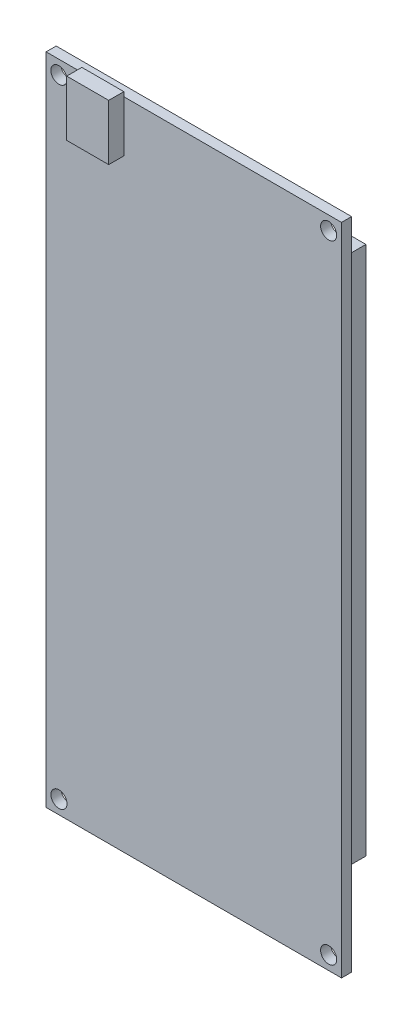
ISO-10303-21;
HEADER;
FILE_DESCRIPTION(('STEP AP214'),'2;1');
FILE_NAME('part.step','',(''),(''),'','','');
FILE_SCHEMA(('AUTOMOTIVE_DESIGN { 1 0 10303 214 1 1 1 1 }'));
ENDSEC;
DATA;
#1=APPLICATION_CONTEXT('core data for automotive mechanical design processes');
#2=APPLICATION_PROTOCOL_DEFINITION('international standard','automotive_design',2000,#1);
#3=PRODUCT_CONTEXT('',#1,'mechanical');
#4=PRODUCT('Part','Part','',(#3));
#5=PRODUCT_RELATED_PRODUCT_CATEGORY('part','',(#4));
#6=PRODUCT_DEFINITION_FORMATION('','',#4);
#7=PRODUCT_DEFINITION_CONTEXT('part definition',#1,'design');
#8=PRODUCT_DEFINITION('design','',#6,#7);
#9=PRODUCT_DEFINITION_SHAPE('','',#8);
#10=(LENGTH_UNIT() NAMED_UNIT(*) SI_UNIT(.MILLI.,.METRE.));
#11=(NAMED_UNIT(*) PLANE_ANGLE_UNIT() SI_UNIT($,.RADIAN.));
#12=(NAMED_UNIT(*) SI_UNIT($,.STERADIAN.) SOLID_ANGLE_UNIT());
#13=UNCERTAINTY_MEASURE_WITH_UNIT(LENGTH_MEASURE(1.E-05),#10,'distance_accuracy_value','');
#14=(GEOMETRIC_REPRESENTATION_CONTEXT(3) GLOBAL_UNCERTAINTY_ASSIGNED_CONTEXT((#13)) GLOBAL_UNIT_ASSIGNED_CONTEXT((#10,
#11,#12)) REPRESENTATION_CONTEXT('',''));
#15=CARTESIAN_POINT('',(0.,0.,0.));
#16=DIRECTION('',(0.,0.,1.));
#17=DIRECTION('',(1.,0.,0.));
#18=AXIS2_PLACEMENT_3D('',#15,#16,#17);
#19=CARTESIAN_POINT('',(0.,0.,0.));
#20=DIRECTION('',(0.,0.,1.));
#21=DIRECTION('',(1.,0.,0.));
#22=AXIS2_PLACEMENT_3D('',#19,#20,#21);
#23=PLANE('',#22);
#24=DIRECTION('',(-1.,0.,0.));
#25=VECTOR('',#24,1.);
#26=CARTESIAN_POINT('',(23.1379222375641,-52.5401368133835,0.));
#27=LINE('',#26,#25);
#28=CARTESIAN_POINT('',(23.1379222375641,-52.5401368133835,0.));
#29=VERTEX_POINT('',#28);
#30=CARTESIAN_POINT('',(18.8416248490762,-52.5401368133835,0.));
#31=VERTEX_POINT('',#30);
#32=EDGE_CURVE('E271',#29,#31,#27,.T.);
#33=ORIENTED_EDGE('',*,*,#32,.F.);
#34=DIRECTION('',(0.,-1.,0.));
#35=VECTOR('',#34,1.);
#36=CARTESIAN_POINT('',(23.1379222375641,52.5401368133835,0.));
#37=LINE('',#36,#35);
#38=CARTESIAN_POINT('',(23.1379222375641,52.5401368133835,0.));
#39=VERTEX_POINT('',#38);
#40=EDGE_CURVE('E267',#39,#29,#37,.T.);
#41=ORIENTED_EDGE('',*,*,#40,.F.);
#42=DIRECTION('',(1.,0.,0.));
#43=VECTOR('',#42,1.);
#44=CARTESIAN_POINT('',(23.1379222375641,52.5401368133835,0.));
#45=LINE('',#44,#43);
#46=CARTESIAN_POINT('',(18.8416248490762,52.5401368133835,0.));
#47=VERTEX_POINT('',#46);
#48=EDGE_CURVE('E263',#47,#39,#45,.T.);
#49=ORIENTED_EDGE('',*,*,#48,.F.);
#50=DIRECTION('',(0.,1.,0.));
#51=VECTOR('',#50,1.);
#52=CARTESIAN_POINT('',(18.8416248490762,52.5401368133835,0.));
#53=LINE('',#52,#51);
#54=EDGE_CURVE('E214',#31,#47,#53,.T.);
#55=ORIENTED_EDGE('',*,*,#54,.F.);
#56=EDGE_LOOP('',(#33,#41,#49,#55));
#57=FACE_BOUND('',#56,.T.);
#58=DIRECTION('',(0.,-1.,0.));
#59=VECTOR('',#58,1.);
#60=CARTESIAN_POINT('',(-29.3,-64.9,0.));
#61=LINE('',#60,#59);
#62=CARTESIAN_POINT('',(-29.3,64.9,0.));
#63=VERTEX_POINT('',#62);
#64=CARTESIAN_POINT('',(-29.3,-64.9,0.));
#65=VERTEX_POINT('',#64);
#66=EDGE_CURVE('E322',#63,#65,#61,.T.);
#67=ORIENTED_EDGE('',*,*,#66,.F.);
#68=DIRECTION('',(-1.,0.,0.));
#69=VECTOR('',#68,1.);
#70=CARTESIAN_POINT('',(29.3,64.9,0.));
#71=LINE('',#70,#69);
#72=CARTESIAN_POINT('',(29.3,64.9,0.));
#73=VERTEX_POINT('',#72);
#74=EDGE_CURVE('E331',#73,#63,#71,.T.);
#75=ORIENTED_EDGE('',*,*,#74,.F.);
#76=DIRECTION('',(0.,1.,0.));
#77=VECTOR('',#76,1.);
#78=CARTESIAN_POINT('',(29.3,-64.9,0.));
#79=LINE('',#78,#77);
#80=CARTESIAN_POINT('',(29.3,-64.9,0.));
#81=VERTEX_POINT('',#80);
#82=EDGE_CURVE('E349',#81,#73,#79,.T.);
#83=ORIENTED_EDGE('',*,*,#82,.F.);
#84=DIRECTION('',(1.,0.,0.));
#85=VECTOR('',#84,1.);
#86=CARTESIAN_POINT('',(29.3,-64.9,0.));
#87=LINE('',#86,#85);
#88=EDGE_CURVE('E346',#65,#81,#87,.T.);
#89=ORIENTED_EDGE('',*,*,#88,.F.);
#90=EDGE_LOOP('',(#67,#75,#83,#89));
#91=FACE_BOUND('',#90,.T.);
#92=CARTESIAN_POINT('',(-26.75,62.2,0.));
#93=DIRECTION('',(0.,0.,1.));
#94=DIRECTION('',(1.,0.,0.));
#95=AXIS2_PLACEMENT_3D('',#92,#93,#94);
#96=CIRCLE('',#95,1.6);
#97=CARTESIAN_POINT('',(-25.15,62.2,0.));
#98=VERTEX_POINT('',#97);
#99=EDGE_CURVE('E314',#98,#98,#96,.T.);
#100=ORIENTED_EDGE('',*,*,#99,.T.);
#101=EDGE_LOOP('',(#100));
#102=FACE_BOUND('',#101,.T.);
#103=CARTESIAN_POINT('',(26.75,62.2,0.));
#104=DIRECTION('',(0.,0.,1.));
#105=DIRECTION('',(1.,0.,0.));
#106=AXIS2_PLACEMENT_3D('',#103,#104,#105);
#107=CIRCLE('',#106,1.6);
#108=CARTESIAN_POINT('',(28.35,62.2,0.));
#109=VERTEX_POINT('',#108);
#110=EDGE_CURVE('E306',#109,#109,#107,.T.);
#111=ORIENTED_EDGE('',*,*,#110,.T.);
#112=EDGE_LOOP('',(#111));
#113=FACE_BOUND('',#112,.T.);
#114=CARTESIAN_POINT('',(-26.75,-62.2,0.));
#115=DIRECTION('',(0.,0.,1.));
#116=DIRECTION('',(1.,0.,0.));
#117=AXIS2_PLACEMENT_3D('',#114,#115,#116);
#118=CIRCLE('',#117,1.6);
#119=CARTESIAN_POINT('',(-25.15,-62.2,0.));
#120=VERTEX_POINT('',#119);
#121=EDGE_CURVE('E298',#120,#120,#118,.T.);
#122=ORIENTED_EDGE('',*,*,#121,.T.);
#123=EDGE_LOOP('',(#122));
#124=FACE_BOUND('',#123,.T.);
#125=CARTESIAN_POINT('',(26.75,-62.2,0.));
#126=DIRECTION('',(0.,0.,1.));
#127=DIRECTION('',(1.,0.,0.));
#128=AXIS2_PLACEMENT_3D('',#125,#126,#127);
#129=CIRCLE('',#128,1.6);
#130=CARTESIAN_POINT('',(28.35,-62.2,0.));
#131=VERTEX_POINT('',#130);
#132=EDGE_CURVE('E259',#131,#131,#129,.T.);
#133=ORIENTED_EDGE('',*,*,#132,.T.);
#134=EDGE_LOOP('',(#133));
#135=FACE_BOUND('',#134,.T.);
#136=DIRECTION('',(1.,0.,0.));
#137=VECTOR('',#136,1.);
#138=CARTESIAN_POINT('',(-23.763324253429,52.5401368133835,0.));
#139=LINE('',#138,#137);
#140=CARTESIAN_POINT('',(-23.763324253429,52.5401368133835,0.));
#141=VERTEX_POINT('',#140);
#142=CARTESIAN_POINT('',(-19.8250516473151,52.5401368133835,0.));
#143=VERTEX_POINT('',#142);
#144=EDGE_CURVE('E223',#141,#143,#139,.T.);
#145=ORIENTED_EDGE('',*,*,#144,.F.);
#146=DIRECTION('',(0.,1.,0.));
#147=VECTOR('',#146,1.);
#148=CARTESIAN_POINT('',(-23.763324253429,52.5401368133835,0.));
#149=LINE('',#148,#147);
#150=CARTESIAN_POINT('',(-23.763324253429,-52.5401368133835,0.));
#151=VERTEX_POINT('',#150);
#152=EDGE_CURVE('E219',#151,#141,#149,.T.);
#153=ORIENTED_EDGE('',*,*,#152,.F.);
#154=DIRECTION('',(-1.,0.,0.));
#155=VECTOR('',#154,1.);
#156=CARTESIAN_POINT('',(-23.763324253429,-52.5401368133835,0.));
#157=LINE('',#156,#155);
#158=CARTESIAN_POINT('',(-19.8250516473151,-52.5401368133835,0.));
#159=VERTEX_POINT('',#158);
#160=EDGE_CURVE('E196',#159,#151,#157,.T.);
#161=ORIENTED_EDGE('',*,*,#160,.F.);
#162=DIRECTION('',(0.,-1.,0.));
#163=VECTOR('',#162,1.);
#164=CARTESIAN_POINT('',(-19.8250516473151,52.5401368133835,0.));
#165=LINE('',#164,#163);
#166=EDGE_CURVE('E191',#143,#159,#165,.T.);
#167=ORIENTED_EDGE('',*,*,#166,.F.);
#168=EDGE_LOOP('',(#145,#153,#161,#167));
#169=FACE_BOUND('',#168,.T.);
#170=ADVANCED_FACE('F43',(#57,#91,#102,#113,#124,#135,#169),#23,.F.);
#171=CARTESIAN_POINT('',(0.,0.,2.));
#172=DIRECTION('',(0.,0.,1.));
#173=DIRECTION('',(1.,0.,0.));
#174=AXIS2_PLACEMENT_3D('',#171,#172,#173);
#175=PLANE('',#174);
#176=DIRECTION('',(0.,1.,0.));
#177=VECTOR('',#176,1.);
#178=CARTESIAN_POINT('',(-13.879355194676,54.7310389309051,2.));
#179=LINE('',#178,#177);
#180=CARTESIAN_POINT('',(-13.879355194676,54.7310389309051,2.));
#181=VERTEX_POINT('',#180);
#182=CARTESIAN_POINT('',(-13.879355194676,64.9,2.));
#183=VERTEX_POINT('',#182);
#184=EDGE_CURVE('E61',#181,#183,#179,.T.);
#185=ORIENTED_EDGE('',*,*,#184,.F.);
#186=DIRECTION('',(1.,0.,0.));
#187=VECTOR('',#186,1.);
#188=CARTESIAN_POINT('',(-22.2050701681274,54.7310389309051,2.));
#189=LINE('',#188,#187);
#190=CARTESIAN_POINT('',(-22.2050701681274,54.7310389309051,2.));
#191=VERTEX_POINT('',#190);
#192=EDGE_CURVE('E184',#191,#181,#189,.T.);
#193=ORIENTED_EDGE('',*,*,#192,.F.);
#194=DIRECTION('',(0.,-1.,0.));
#195=VECTOR('',#194,1.);
#196=CARTESIAN_POINT('',(-22.2050701681274,54.7310389309051,2.));
#197=LINE('',#196,#195);
#198=CARTESIAN_POINT('',(-22.2050701681274,64.9,2.));
#199=VERTEX_POINT('',#198);
#200=EDGE_CURVE('E12',#199,#191,#197,.T.);
#201=ORIENTED_EDGE('',*,*,#200,.F.);
#202=DIRECTION('',(-1.,0.,0.));
#203=VECTOR('',#202,1.);
#204=CARTESIAN_POINT('',(29.3,64.9,2.));
#205=LINE('',#204,#203);
#206=CARTESIAN_POINT('',(-29.3,64.9,2.));
#207=VERTEX_POINT('',#206);
#208=EDGE_CURVE('E337',#199,#207,#205,.T.);
#209=ORIENTED_EDGE('',*,*,#208,.T.);
#210=DIRECTION('',(0.,-1.,0.));
#211=VECTOR('',#210,1.);
#212=CARTESIAN_POINT('',(-29.3,-64.9,2.));
#213=LINE('',#212,#211);
#214=CARTESIAN_POINT('',(-29.3,-64.9,2.));
#215=VERTEX_POINT('',#214);
#216=EDGE_CURVE('E326',#207,#215,#213,.T.);
#217=ORIENTED_EDGE('',*,*,#216,.T.);
#218=DIRECTION('',(1.,0.,0.));
#219=VECTOR('',#218,1.);
#220=CARTESIAN_POINT('',(29.3,-64.9,2.));
#221=LINE('',#220,#219);
#222=CARTESIAN_POINT('',(29.3,-64.9,2.));
#223=VERTEX_POINT('',#222);
#224=EDGE_CURVE('E330',#215,#223,#221,.T.);
#225=ORIENTED_EDGE('',*,*,#224,.T.);
#226=DIRECTION('',(0.,1.,0.));
#227=VECTOR('',#226,1.);
#228=CARTESIAN_POINT('',(29.3,-64.9,2.));
#229=LINE('',#228,#227);
#230=CARTESIAN_POINT('',(29.3,64.9,2.));
#231=VERTEX_POINT('',#230);
#232=EDGE_CURVE('E334',#223,#231,#229,.T.);
#233=ORIENTED_EDGE('',*,*,#232,.T.);
#234=EDGE_CURVE('E338',#231,#183,#205,.T.);
#235=ORIENTED_EDGE('',*,*,#234,.T.);
#236=EDGE_LOOP('',(#185,#193,#201,#209,#217,#225,#233,#235));
#237=FACE_BOUND('',#236,.T.);
#238=CARTESIAN_POINT('',(-26.75,-62.2,2.));
#239=DIRECTION('',(0.,0.,1.));
#240=DIRECTION('',(1.,0.,0.));
#241=AXIS2_PLACEMENT_3D('',#238,#239,#240);
#242=CIRCLE('',#241,1.6);
#243=CARTESIAN_POINT('',(-25.15,-62.2,2.));
#244=VERTEX_POINT('',#243);
#245=EDGE_CURVE('E302',#244,#244,#242,.T.);
#246=ORIENTED_EDGE('',*,*,#245,.F.);
#247=EDGE_LOOP('',(#246));
#248=FACE_BOUND('',#247,.T.);
#249=CARTESIAN_POINT('',(-26.75,62.2,2.));
#250=DIRECTION('',(0.,0.,1.));
#251=DIRECTION('',(1.,0.,0.));
#252=AXIS2_PLACEMENT_3D('',#249,#250,#251);
#253=CIRCLE('',#252,1.6);
#254=CARTESIAN_POINT('',(-25.15,62.2,2.));
#255=VERTEX_POINT('',#254);
#256=EDGE_CURVE('E318',#255,#255,#253,.T.);
#257=ORIENTED_EDGE('',*,*,#256,.F.);
#258=EDGE_LOOP('',(#257));
#259=FACE_BOUND('',#258,.T.);
#260=CARTESIAN_POINT('',(26.75,62.2,2.));
#261=DIRECTION('',(0.,0.,1.));
#262=DIRECTION('',(1.,0.,0.));
#263=AXIS2_PLACEMENT_3D('',#260,#261,#262);
#264=CIRCLE('',#263,1.6);
#265=CARTESIAN_POINT('',(28.35,62.2,2.));
#266=VERTEX_POINT('',#265);
#267=EDGE_CURVE('E310',#266,#266,#264,.T.);
#268=ORIENTED_EDGE('',*,*,#267,.F.);
#269=EDGE_LOOP('',(#268));
#270=FACE_BOUND('',#269,.T.);
#271=CARTESIAN_POINT('',(26.75,-62.2,2.));
#272=DIRECTION('',(0.,0.,1.));
#273=DIRECTION('',(1.,0.,0.));
#274=AXIS2_PLACEMENT_3D('',#271,#272,#273);
#275=CIRCLE('',#274,1.6);
#276=CARTESIAN_POINT('',(28.35,-62.2,2.));
#277=VERTEX_POINT('',#276);
#278=EDGE_CURVE('E294',#277,#277,#275,.T.);
#279=ORIENTED_EDGE('',*,*,#278,.F.);
#280=EDGE_LOOP('',(#279));
#281=FACE_BOUND('',#280,.T.);
#282=ADVANCED_FACE('F385',(#237,#248,#259,#270,#281),#175,.T.);
#283=CARTESIAN_POINT('',(-29.3,-64.9,2.));
#284=DIRECTION('',(1.,0.,0.));
#285=DIRECTION('',(0.,0.,-1.));
#286=AXIS2_PLACEMENT_3D('',#283,#284,#285);
#287=PLANE('',#286);
#288=ORIENTED_EDGE('',*,*,#66,.T.);
#289=DIRECTION('',(0.,0.,-1.));
#290=VECTOR('',#289,1.);
#291=CARTESIAN_POINT('',(-29.3,-64.9,2.));
#292=LINE('',#291,#290);
#293=EDGE_CURVE('E47',#215,#65,#292,.T.);
#294=ORIENTED_EDGE('',*,*,#293,.F.);
#295=ORIENTED_EDGE('',*,*,#216,.F.);
#296=DIRECTION('',(0.,0.,-1.));
#297=VECTOR('',#296,1.);
#298=CARTESIAN_POINT('',(-29.3,64.9,2.));
#299=LINE('',#298,#297);
#300=EDGE_CURVE('E341',#207,#63,#299,.T.);
#301=ORIENTED_EDGE('',*,*,#300,.T.);
#302=EDGE_LOOP('',(#288,#294,#295,#301));
#303=FACE_BOUND('',#302,.T.);
#304=ADVANCED_FACE('F45',(#303),#287,.F.);
#305=CARTESIAN_POINT('',(29.3,-64.9,2.));
#306=DIRECTION('',(0.,1.,0.));
#307=DIRECTION('',(0.,0.,1.));
#308=AXIS2_PLACEMENT_3D('',#305,#306,#307);
#309=PLANE('',#308);
#310=ORIENTED_EDGE('',*,*,#88,.T.);
#311=DIRECTION('',(0.,0.,-1.));
#312=VECTOR('',#311,1.);
#313=CARTESIAN_POINT('',(29.3,-64.9,2.));
#314=LINE('',#313,#312);
#315=EDGE_CURVE('E360',#223,#81,#314,.T.);
#316=ORIENTED_EDGE('',*,*,#315,.F.);
#317=ORIENTED_EDGE('',*,*,#224,.F.);
#318=ORIENTED_EDGE('',*,*,#293,.T.);
#319=EDGE_LOOP('',(#310,#316,#317,#318));
#320=FACE_BOUND('',#319,.T.);
#321=ADVANCED_FACE('F371',(#320),#309,.F.);
#322=CARTESIAN_POINT('',(29.3,-64.9,2.));
#323=DIRECTION('',(-1.,0.,0.));
#324=DIRECTION('',(0.,-1.,0.));
#325=AXIS2_PLACEMENT_3D('',#322,#323,#324);
#326=PLANE('',#325);
#327=ORIENTED_EDGE('',*,*,#82,.T.);
#328=DIRECTION('',(0.,0.,-1.));
#329=VECTOR('',#328,1.);
#330=CARTESIAN_POINT('',(29.3,64.9,2.));
#331=LINE('',#330,#329);
#332=EDGE_CURVE('E357',#231,#73,#331,.T.);
#333=ORIENTED_EDGE('',*,*,#332,.F.);
#334=ORIENTED_EDGE('',*,*,#232,.F.);
#335=ORIENTED_EDGE('',*,*,#315,.T.);
#336=EDGE_LOOP('',(#327,#333,#334,#335));
#337=FACE_BOUND('',#336,.T.);
#338=ADVANCED_FACE('F380',(#337),#326,.F.);
#339=CARTESIAN_POINT('',(29.3,64.9,2.));
#340=DIRECTION('',(0.,-1.,0.));
#341=DIRECTION('',(1.,0.,0.));
#342=AXIS2_PLACEMENT_3D('',#339,#340,#341);
#343=PLANE('',#342);
#344=ORIENTED_EDGE('',*,*,#74,.T.);
#345=ORIENTED_EDGE('',*,*,#300,.F.);
#346=ORIENTED_EDGE('',*,*,#208,.F.);
#347=EDGE_CURVE('E342',#183,#199,#205,.T.);
#348=ORIENTED_EDGE('',*,*,#347,.F.);
#349=ORIENTED_EDGE('',*,*,#234,.F.);
#350=ORIENTED_EDGE('',*,*,#332,.T.);
#351=EDGE_LOOP('',(#344,#345,#346,#348,#349,#350));
#352=FACE_BOUND('',#351,.T.);
#353=ADVANCED_FACE('F383',(#352),#343,.F.);
#354=CARTESIAN_POINT('',(-26.75,62.2,2.));
#355=DIRECTION('',(0.,0.,-1.));
#356=DIRECTION('',(-1.,0.,0.));
#357=AXIS2_PLACEMENT_3D('',#354,#355,#356);
#358=CYLINDRICAL_SURFACE('',#357,1.6);
#359=ORIENTED_EDGE('',*,*,#256,.T.);
#360=EDGE_LOOP('',(#359));
#361=FACE_BOUND('',#360,.T.);
#362=ORIENTED_EDGE('',*,*,#99,.F.);
#363=EDGE_LOOP('',(#362));
#364=FACE_BOUND('',#363,.T.);
#365=ADVANCED_FACE('F434',(#361,#364),#358,.F.);
#366=CARTESIAN_POINT('',(26.75,62.2,2.));
#367=DIRECTION('',(0.,0.,-1.));
#368=DIRECTION('',(-1.,0.,0.));
#369=AXIS2_PLACEMENT_3D('',#366,#367,#368);
#370=CYLINDRICAL_SURFACE('',#369,1.6);
#371=ORIENTED_EDGE('',*,*,#267,.T.);
#372=EDGE_LOOP('',(#371));
#373=FACE_BOUND('',#372,.T.);
#374=ORIENTED_EDGE('',*,*,#110,.F.);
#375=EDGE_LOOP('',(#374));
#376=FACE_BOUND('',#375,.T.);
#377=ADVANCED_FACE('F587',(#373,#376),#370,.F.);
#378=CARTESIAN_POINT('',(-26.75,-62.2,2.));
#379=DIRECTION('',(0.,0.,-1.));
#380=DIRECTION('',(-1.,0.,0.));
#381=AXIS2_PLACEMENT_3D('',#378,#379,#380);
#382=CYLINDRICAL_SURFACE('',#381,1.6);
#383=ORIENTED_EDGE('',*,*,#245,.T.);
#384=EDGE_LOOP('',(#383));
#385=FACE_BOUND('',#384,.T.);
#386=ORIENTED_EDGE('',*,*,#121,.F.);
#387=EDGE_LOOP('',(#386));
#388=FACE_BOUND('',#387,.T.);
#389=ADVANCED_FACE('F579',(#385,#388),#382,.F.);
#390=CARTESIAN_POINT('',(26.75,-62.2,2.));
#391=DIRECTION('',(0.,0.,-1.));
#392=DIRECTION('',(-1.,0.,0.));
#393=AXIS2_PLACEMENT_3D('',#390,#391,#392);
#394=CYLINDRICAL_SURFACE('',#393,1.6);
#395=ORIENTED_EDGE('',*,*,#278,.T.);
#396=EDGE_LOOP('',(#395));
#397=FACE_BOUND('',#396,.T.);
#398=ORIENTED_EDGE('',*,*,#132,.F.);
#399=EDGE_LOOP('',(#398));
#400=FACE_BOUND('',#399,.T.);
#401=ADVANCED_FACE('F571',(#397,#400),#394,.F.);
#402=CARTESIAN_POINT('',(23.1379222375641,-52.5401368133835,-125.168065859968));
#403=DIRECTION('',(0.,1.,0.));
#404=DIRECTION('',(0.,0.,1.));
#405=AXIS2_PLACEMENT_3D('',#402,#403,#404);
#406=PLANE('',#405);
#407=DIRECTION('',(0.,0.,1.));
#408=VECTOR('',#407,1.);
#409=CARTESIAN_POINT('',(18.8416248490762,-52.5401368133835,-125.168065859968));
#410=LINE('',#409,#408);
#411=CARTESIAN_POINT('',(18.8416248490762,-52.5401368133835,-8.99999999999999));
#412=VERTEX_POINT('',#411);
#413=EDGE_CURVE('E275',#412,#31,#410,.T.);
#414=ORIENTED_EDGE('',*,*,#413,.F.);
#415=DIRECTION('',(1.,0.,0.));
#416=VECTOR('',#415,1.);
#417=CARTESIAN_POINT('',(23.1379222375641,-52.5401368133835,-8.99999999999999));
#418=LINE('',#417,#416);
#419=CARTESIAN_POINT('',(23.1379222375641,-52.5401368133835,-8.99999999999999));
#420=VERTEX_POINT('',#419);
#421=EDGE_CURVE('E251',#412,#420,#418,.T.);
#422=ORIENTED_EDGE('',*,*,#421,.T.);
#423=DIRECTION('',(0.,0.,1.));
#424=VECTOR('',#423,1.);
#425=CARTESIAN_POINT('',(23.1379222375641,-52.5401368133835,-125.168065859968));
#426=LINE('',#425,#424);
#427=EDGE_CURVE('E279',#420,#29,#426,.T.);
#428=ORIENTED_EDGE('',*,*,#427,.T.);
#429=ORIENTED_EDGE('',*,*,#32,.T.);
#430=EDGE_LOOP('',(#414,#422,#428,#429));
#431=FACE_BOUND('',#430,.T.);
#432=ADVANCED_FACE('F563',(#431),#406,.F.);
#433=CARTESIAN_POINT('',(23.1379222375641,52.5401368133835,-125.168065859968));
#434=DIRECTION('',(-1.,0.,0.));
#435=DIRECTION('',(0.,0.,1.));
#436=AXIS2_PLACEMENT_3D('',#433,#434,#435);
#437=PLANE('',#436);
#438=ORIENTED_EDGE('',*,*,#427,.F.);
#439=DIRECTION('',(0.,1.,0.));
#440=VECTOR('',#439,1.);
#441=CARTESIAN_POINT('',(23.1379222375641,52.5401368133835,-8.99999999999999));
#442=LINE('',#441,#440);
#443=CARTESIAN_POINT('',(23.1379222375641,52.5401368133835,-8.99999999999999));
#444=VERTEX_POINT('',#443);
#445=EDGE_CURVE('E246',#420,#444,#442,.T.);
#446=ORIENTED_EDGE('',*,*,#445,.T.);
#447=DIRECTION('',(0.,0.,1.));
#448=VECTOR('',#447,1.);
#449=CARTESIAN_POINT('',(23.1379222375641,52.5401368133835,-125.168065859968));
#450=LINE('',#449,#448);
#451=EDGE_CURVE('E283',#444,#39,#450,.T.);
#452=ORIENTED_EDGE('',*,*,#451,.T.);
#453=ORIENTED_EDGE('',*,*,#40,.T.);
#454=EDGE_LOOP('',(#438,#446,#452,#453));
#455=FACE_BOUND('',#454,.T.);
#456=ADVANCED_FACE('F555',(#455),#437,.F.);
#457=CARTESIAN_POINT('',(23.1379222375641,52.5401368133835,-125.168065859968));
#458=DIRECTION('',(0.,-1.,0.));
#459=DIRECTION('',(0.,0.,-1.));
#460=AXIS2_PLACEMENT_3D('',#457,#458,#459);
#461=PLANE('',#460);
#462=ORIENTED_EDGE('',*,*,#451,.F.);
#463=DIRECTION('',(-1.,0.,0.));
#464=VECTOR('',#463,1.);
#465=CARTESIAN_POINT('',(23.1379222375641,52.5401368133835,-8.99999999999999));
#466=LINE('',#465,#464);
#467=CARTESIAN_POINT('',(18.8416248490762,52.5401368133835,-8.99999999999999));
#468=VERTEX_POINT('',#467);
#469=EDGE_CURVE('E250',#444,#468,#466,.T.);
#470=ORIENTED_EDGE('',*,*,#469,.T.);
#471=DIRECTION('',(0.,0.,1.));
#472=VECTOR('',#471,1.);
#473=CARTESIAN_POINT('',(18.8416248490762,52.5401368133835,-125.168065859968));
#474=LINE('',#473,#472);
#475=EDGE_CURVE('E287',#468,#47,#474,.T.);
#476=ORIENTED_EDGE('',*,*,#475,.T.);
#477=ORIENTED_EDGE('',*,*,#48,.T.);
#478=EDGE_LOOP('',(#462,#470,#476,#477));
#479=FACE_BOUND('',#478,.T.);
#480=ADVANCED_FACE('F547',(#479),#461,.F.);
#481=CARTESIAN_POINT('',(18.8416248490762,52.5401368133835,-125.168065859968));
#482=DIRECTION('',(1.,0.,0.));
#483=DIRECTION('',(0.,0.,-1.));
#484=AXIS2_PLACEMENT_3D('',#481,#482,#483);
#485=PLANE('',#484);
#486=ORIENTED_EDGE('',*,*,#475,.F.);
#487=DIRECTION('',(0.,-1.,0.));
#488=VECTOR('',#487,1.);
#489=CARTESIAN_POINT('',(18.8416248490762,52.5401368133835,-8.99999999999999));
#490=LINE('',#489,#488);
#491=EDGE_CURVE('E255',#468,#412,#490,.T.);
#492=ORIENTED_EDGE('',*,*,#491,.T.);
#493=ORIENTED_EDGE('',*,*,#413,.T.);
#494=ORIENTED_EDGE('',*,*,#54,.T.);
#495=EDGE_LOOP('',(#486,#492,#493,#494));
#496=FACE_BOUND('',#495,.T.);
#497=ADVANCED_FACE('F539',(#496),#485,.F.);
#498=CARTESIAN_POINT('',(0.,0.,-9.));
#499=DIRECTION('',(0.,0.,1.));
#500=DIRECTION('',(1.,0.,0.));
#501=AXIS2_PLACEMENT_3D('',#498,#499,#500);
#502=PLANE('',#501);
#503=ORIENTED_EDGE('',*,*,#469,.F.);
#504=ORIENTED_EDGE('',*,*,#445,.F.);
#505=ORIENTED_EDGE('',*,*,#421,.F.);
#506=ORIENTED_EDGE('',*,*,#491,.F.);
#507=EDGE_LOOP('',(#503,#504,#505,#506));
#508=FACE_BOUND('',#507,.T.);
#509=ADVANCED_FACE('F531',(#508),#502,.F.);
#510=CARTESIAN_POINT('',(-23.763324253429,52.5401368133835,-125.168065859968));
#511=DIRECTION('',(0.,-1.,0.));
#512=DIRECTION('',(0.,0.,-1.));
#513=AXIS2_PLACEMENT_3D('',#510,#511,#512);
#514=PLANE('',#513);
#515=DIRECTION('',(0.,0.,1.));
#516=VECTOR('',#515,1.);
#517=CARTESIAN_POINT('',(-19.8250516473151,52.5401368133835,-125.168065859968));
#518=LINE('',#517,#516);
#519=CARTESIAN_POINT('',(-19.8250516473151,52.5401368133835,-8.99999999999999));
#520=VERTEX_POINT('',#519);
#521=EDGE_CURVE('E227',#520,#143,#518,.T.);
#522=ORIENTED_EDGE('',*,*,#521,.F.);
#523=DIRECTION('',(-1.,0.,0.));
#524=VECTOR('',#523,1.);
#525=CARTESIAN_POINT('',(-23.763324253429,52.5401368133835,-8.99999999999999));
#526=LINE('',#525,#524);
#527=CARTESIAN_POINT('',(-23.763324253429,52.5401368133835,-8.99999999999999));
#528=VERTEX_POINT('',#527);
#529=EDGE_CURVE('E207',#520,#528,#526,.T.);
#530=ORIENTED_EDGE('',*,*,#529,.T.);
#531=DIRECTION('',(0.,0.,1.));
#532=VECTOR('',#531,1.);
#533=CARTESIAN_POINT('',(-23.763324253429,52.5401368133835,-125.168065859968));
#534=LINE('',#533,#532);
#535=EDGE_CURVE('E231',#528,#141,#534,.T.);
#536=ORIENTED_EDGE('',*,*,#535,.T.);
#537=ORIENTED_EDGE('',*,*,#144,.T.);
#538=EDGE_LOOP('',(#522,#530,#536,#537));
#539=FACE_BOUND('',#538,.T.);
#540=ADVANCED_FACE('F523',(#539),#514,.F.);
#541=CARTESIAN_POINT('',(-23.763324253429,52.5401368133835,-125.168065859968));
#542=DIRECTION('',(1.,0.,0.));
#543=DIRECTION('',(0.,0.,-1.));
#544=AXIS2_PLACEMENT_3D('',#541,#542,#543);
#545=PLANE('',#544);
#546=ORIENTED_EDGE('',*,*,#535,.F.);
#547=DIRECTION('',(0.,-1.,0.));
#548=VECTOR('',#547,1.);
#549=CARTESIAN_POINT('',(-23.763324253429,52.5401368133835,-8.99999999999999));
#550=LINE('',#549,#548);
#551=CARTESIAN_POINT('',(-23.763324253429,-52.5401368133835,-8.99999999999999));
#552=VERTEX_POINT('',#551);
#553=EDGE_CURVE('E202',#528,#552,#550,.T.);
#554=ORIENTED_EDGE('',*,*,#553,.T.);
#555=DIRECTION('',(0.,0.,1.));
#556=VECTOR('',#555,1.);
#557=CARTESIAN_POINT('',(-23.763324253429,-52.5401368133835,-125.168065859968));
#558=LINE('',#557,#556);
#559=EDGE_CURVE('E235',#552,#151,#558,.T.);
#560=ORIENTED_EDGE('',*,*,#559,.T.);
#561=ORIENTED_EDGE('',*,*,#152,.T.);
#562=EDGE_LOOP('',(#546,#554,#560,#561));
#563=FACE_BOUND('',#562,.T.);
#564=ADVANCED_FACE('F515',(#563),#545,.F.);
#565=CARTESIAN_POINT('',(-23.763324253429,-52.5401368133835,-125.168065859968));
#566=DIRECTION('',(0.,1.,0.));
#567=DIRECTION('',(0.,0.,1.));
#568=AXIS2_PLACEMENT_3D('',#565,#566,#567);
#569=PLANE('',#568);
#570=ORIENTED_EDGE('',*,*,#559,.F.);
#571=DIRECTION('',(1.,0.,0.));
#572=VECTOR('',#571,1.);
#573=CARTESIAN_POINT('',(-23.763324253429,-52.5401368133835,-8.99999999999999));
#574=LINE('',#573,#572);
#575=CARTESIAN_POINT('',(-19.8250516473151,-52.5401368133835,-8.99999999999999));
#576=VERTEX_POINT('',#575);
#577=EDGE_CURVE('E206',#552,#576,#574,.T.);
#578=ORIENTED_EDGE('',*,*,#577,.T.);
#579=DIRECTION('',(0.,0.,1.));
#580=VECTOR('',#579,1.);
#581=CARTESIAN_POINT('',(-19.8250516473151,-52.5401368133835,-125.168065859968));
#582=LINE('',#581,#580);
#583=EDGE_CURVE('E239',#576,#159,#582,.T.);
#584=ORIENTED_EDGE('',*,*,#583,.T.);
#585=ORIENTED_EDGE('',*,*,#160,.T.);
#586=EDGE_LOOP('',(#570,#578,#584,#585));
#587=FACE_BOUND('',#586,.T.);
#588=ADVANCED_FACE('F507',(#587),#569,.F.);
#589=CARTESIAN_POINT('',(-19.8250516473151,52.5401368133835,-125.168065859968));
#590=DIRECTION('',(-1.,0.,0.));
#591=DIRECTION('',(0.,0.,1.));
#592=AXIS2_PLACEMENT_3D('',#589,#590,#591);
#593=PLANE('',#592);
#594=ORIENTED_EDGE('',*,*,#583,.F.);
#595=DIRECTION('',(0.,1.,0.));
#596=VECTOR('',#595,1.);
#597=CARTESIAN_POINT('',(-19.8250516473151,52.5401368133835,-8.99999999999999));
#598=LINE('',#597,#596);
#599=EDGE_CURVE('E211',#576,#520,#598,.T.);
#600=ORIENTED_EDGE('',*,*,#599,.T.);
#601=ORIENTED_EDGE('',*,*,#521,.T.);
#602=ORIENTED_EDGE('',*,*,#166,.T.);
#603=EDGE_LOOP('',(#594,#600,#601,#602));
#604=FACE_BOUND('',#603,.T.);
#605=ADVANCED_FACE('F502',(#604),#593,.F.);
#606=CARTESIAN_POINT('',(0.,0.,-9.));
#607=DIRECTION('',(0.,0.,1.));
#608=DIRECTION('',(1.,0.,0.));
#609=AXIS2_PLACEMENT_3D('',#606,#607,#608);
#610=PLANE('',#609);
#611=ORIENTED_EDGE('',*,*,#577,.F.);
#612=ORIENTED_EDGE('',*,*,#553,.F.);
#613=ORIENTED_EDGE('',*,*,#529,.F.);
#614=ORIENTED_EDGE('',*,*,#599,.F.);
#615=EDGE_LOOP('',(#611,#612,#613,#614));
#616=FACE_BOUND('',#615,.T.);
#617=ADVANCED_FACE('F450',(#616),#610,.F.);
#618=CARTESIAN_POINT('',(-13.879355194676,54.7310389309051,5.));
#619=DIRECTION('',(-1.,0.,0.));
#620=DIRECTION('',(0.,0.,1.));
#621=AXIS2_PLACEMENT_3D('',#618,#619,#620);
#622=PLANE('',#621);
#623=ORIENTED_EDGE('',*,*,#184,.T.);
#624=CARTESIAN_POINT('',(-13.879355194676,65.7753547120141,2.));
#625=VERTEX_POINT('',#624);
#626=EDGE_CURVE('E188',#183,#625,#179,.T.);
#627=ORIENTED_EDGE('',*,*,#626,.T.);
#628=DIRECTION('',(0.,0.,-1.));
#629=VECTOR('',#628,1.);
#630=CARTESIAN_POINT('',(-13.879355194676,65.7753547120141,5.));
#631=LINE('',#630,#629);
#632=CARTESIAN_POINT('',(-13.879355194676,65.7753547120141,5.));
#633=VERTEX_POINT('',#632);
#634=EDGE_CURVE('E167',#633,#625,#631,.T.);
#635=ORIENTED_EDGE('',*,*,#634,.F.);
#636=DIRECTION('',(0.,1.,0.));
#637=VECTOR('',#636,1.);
#638=CARTESIAN_POINT('',(-13.879355194676,54.7310389309051,5.));
#639=LINE('',#638,#637);
#640=CARTESIAN_POINT('',(-13.879355194676,54.7310389309051,5.));
#641=VERTEX_POINT('',#640);
#642=EDGE_CURVE('E174',#641,#633,#639,.T.);
#643=ORIENTED_EDGE('',*,*,#642,.F.);
#644=DIRECTION('',(0.,0.,-1.));
#645=VECTOR('',#644,1.);
#646=CARTESIAN_POINT('',(-13.879355194676,54.7310389309051,5.));
#647=LINE('',#646,#645);
#648=EDGE_CURVE('E394',#641,#181,#647,.T.);
#649=ORIENTED_EDGE('',*,*,#648,.T.);
#650=EDGE_LOOP('',(#623,#627,#635,#643,#649));
#651=FACE_BOUND('',#650,.T.);
#652=ADVANCED_FACE('F186',(#651),#622,.F.);
#653=CARTESIAN_POINT('',(-22.2050701681274,65.7753547120141,5.));
#654=DIRECTION('',(0.,-1.,0.));
#655=DIRECTION('',(0.,0.,-1.));
#656=AXIS2_PLACEMENT_3D('',#653,#654,#655);
#657=PLANE('',#656);
#658=DIRECTION('',(-1.,0.,0.));
#659=VECTOR('',#658,1.);
#660=CARTESIAN_POINT('',(-22.2050701681274,65.7753547120141,2.));
#661=LINE('',#660,#659);
#662=CARTESIAN_POINT('',(-22.2050701681274,65.7753547120141,2.));
#663=VERTEX_POINT('',#662);
#664=EDGE_CURVE('E391',#625,#663,#661,.T.);
#665=ORIENTED_EDGE('',*,*,#664,.T.);
#666=DIRECTION('',(0.,0.,-1.));
#667=VECTOR('',#666,1.);
#668=CARTESIAN_POINT('',(-22.2050701681274,65.7753547120141,5.));
#669=LINE('',#668,#667);
#670=CARTESIAN_POINT('',(-22.2050701681274,65.7753547120141,5.));
#671=VERTEX_POINT('',#670);
#672=EDGE_CURVE('E169',#671,#663,#669,.T.);
#673=ORIENTED_EDGE('',*,*,#672,.F.);
#674=DIRECTION('',(-1.,0.,0.));
#675=VECTOR('',#674,1.);
#676=CARTESIAN_POINT('',(-22.2050701681274,65.7753547120141,5.));
#677=LINE('',#676,#675);
#678=EDGE_CURVE('E163',#633,#671,#677,.T.);
#679=ORIENTED_EDGE('',*,*,#678,.F.);
#680=ORIENTED_EDGE('',*,*,#634,.T.);
#681=EDGE_LOOP('',(#665,#673,#679,#680));
#682=FACE_BOUND('',#681,.T.);
#683=ADVANCED_FACE('F165',(#682),#657,.F.);
#684=CARTESIAN_POINT('',(-22.2050701681274,54.7310389309051,5.));
#685=DIRECTION('',(1.,0.,0.));
#686=DIRECTION('',(0.,0.,-1.));
#687=AXIS2_PLACEMENT_3D('',#684,#685,#686);
#688=PLANE('',#687);
#689=EDGE_CURVE('E54',#663,#199,#197,.T.);
#690=ORIENTED_EDGE('',*,*,#689,.T.);
#691=ORIENTED_EDGE('',*,*,#200,.T.);
#692=DIRECTION('',(0.,0.,-1.));
#693=VECTOR('',#692,1.);
#694=CARTESIAN_POINT('',(-22.2050701681274,54.7310389309051,5.));
#695=LINE('',#694,#693);
#696=CARTESIAN_POINT('',(-22.2050701681274,54.7310389309051,5.));
#697=VERTEX_POINT('',#696);
#698=EDGE_CURVE('E198',#697,#191,#695,.T.);
#699=ORIENTED_EDGE('',*,*,#698,.F.);
#700=DIRECTION('',(0.,-1.,0.));
#701=VECTOR('',#700,1.);
#702=CARTESIAN_POINT('',(-22.2050701681274,54.7310389309051,5.));
#703=LINE('',#702,#701);
#704=EDGE_CURVE('E173',#671,#697,#703,.T.);
#705=ORIENTED_EDGE('',*,*,#704,.F.);
#706=ORIENTED_EDGE('',*,*,#672,.T.);
#707=EDGE_LOOP('',(#690,#691,#699,#705,#706));
#708=FACE_BOUND('',#707,.T.);
#709=ADVANCED_FACE('F411',(#708),#688,.F.);
#710=CARTESIAN_POINT('',(-22.2050701681274,54.7310389309051,5.));
#711=DIRECTION('',(0.,1.,0.));
#712=DIRECTION('',(0.,0.,1.));
#713=AXIS2_PLACEMENT_3D('',#710,#711,#712);
#714=PLANE('',#713);
#715=ORIENTED_EDGE('',*,*,#192,.T.);
#716=ORIENTED_EDGE('',*,*,#648,.F.);
#717=DIRECTION('',(1.,0.,0.));
#718=VECTOR('',#717,1.);
#719=CARTESIAN_POINT('',(-22.2050701681274,54.7310389309051,5.));
#720=LINE('',#719,#718);
#721=EDGE_CURVE('E179',#697,#641,#720,.T.);
#722=ORIENTED_EDGE('',*,*,#721,.F.);
#723=ORIENTED_EDGE('',*,*,#698,.T.);
#724=EDGE_LOOP('',(#715,#716,#722,#723));
#725=FACE_BOUND('',#724,.T.);
#726=ADVANCED_FACE('F409',(#725),#714,.F.);
#727=CARTESIAN_POINT('',(0.,0.,5.));
#728=DIRECTION('',(0.,0.,-1.));
#729=DIRECTION('',(-1.,0.,0.));
#730=AXIS2_PLACEMENT_3D('',#727,#728,#729);
#731=PLANE('',#730);
#732=ORIENTED_EDGE('',*,*,#642,.T.);
#733=ORIENTED_EDGE('',*,*,#678,.T.);
#734=ORIENTED_EDGE('',*,*,#704,.T.);
#735=ORIENTED_EDGE('',*,*,#721,.T.);
#736=EDGE_LOOP('',(#732,#733,#734,#735));
#737=FACE_BOUND('',#736,.T.);
#738=ADVANCED_FACE('F177',(#737),#731,.F.);
#739=CARTESIAN_POINT('',(0.,0.,2.));
#740=DIRECTION('',(0.,0.,-1.));
#741=DIRECTION('',(-1.,0.,0.));
#742=AXIS2_PLACEMENT_3D('',#739,#740,#741);
#743=PLANE('',#742);
#744=ORIENTED_EDGE('',*,*,#626,.F.);
#745=ORIENTED_EDGE('',*,*,#347,.T.);
#746=ORIENTED_EDGE('',*,*,#689,.F.);
#747=ORIENTED_EDGE('',*,*,#664,.F.);
#748=EDGE_LOOP('',(#744,#745,#746,#747));
#749=FACE_BOUND('',#748,.T.);
#750=ADVANCED_FACE('F388',(#749),#743,.T.);
#751=CLOSED_SHELL('',(#170,#282,#304,#321,#338,#353,#365,#377,#389,#401,#432,#456,#480,#497,
#509,#540,#564,#588,#605,#617,#652,#683,#709,#726,#738,#750));
#752=MANIFOLD_SOLID_BREP('B2',#751);
#753=ADVANCED_BREP_SHAPE_REPRESENTATION('',(#18,#752),#14);
#754=SHAPE_DEFINITION_REPRESENTATION(#9,#753);
ENDSEC;
END-ISO-10303-21;
